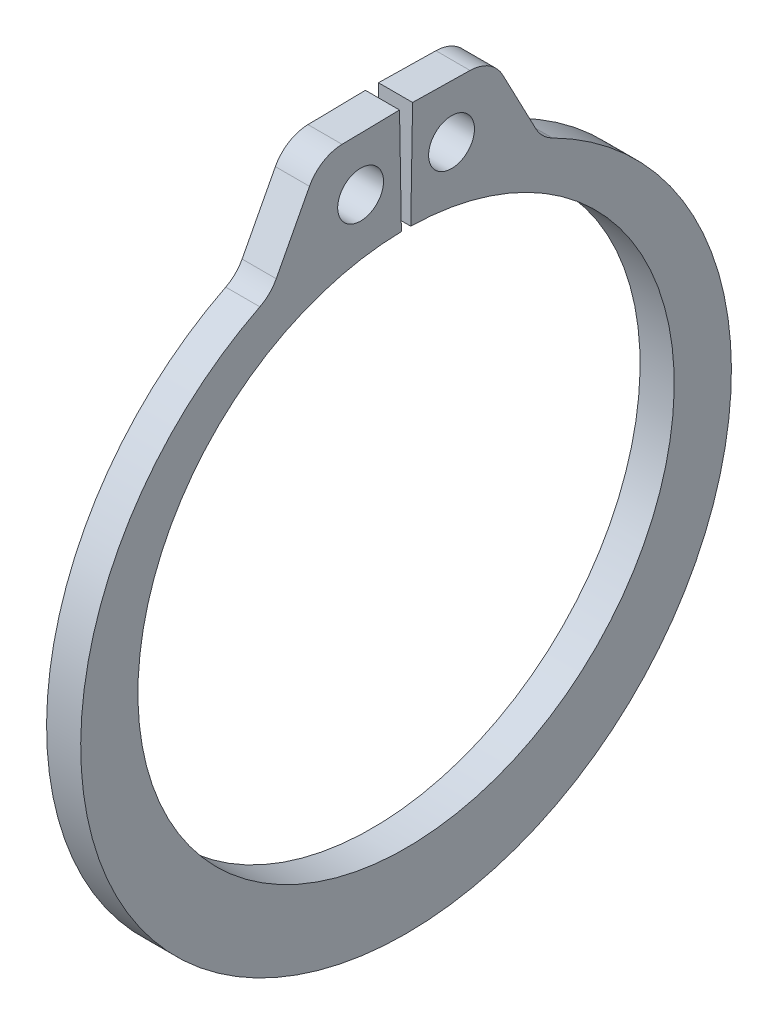
ISO-10303-21;
HEADER;
FILE_DESCRIPTION(('STEP AP214'),'2;1');
FILE_NAME('part.step','',(''),(''),'','','');
FILE_SCHEMA(('AUTOMOTIVE_DESIGN { 1 0 10303 214 1 1 1 1 }'));
ENDSEC;
DATA;
#1=APPLICATION_CONTEXT('core data for automotive mechanical design processes');
#2=APPLICATION_PROTOCOL_DEFINITION('international standard','automotive_design',2000,#1);
#3=PRODUCT_CONTEXT('',#1,'mechanical');
#4=PRODUCT('Part','Part','',(#3));
#5=PRODUCT_RELATED_PRODUCT_CATEGORY('part','',(#4));
#6=PRODUCT_DEFINITION_FORMATION('','',#4);
#7=PRODUCT_DEFINITION_CONTEXT('part definition',#1,'design');
#8=PRODUCT_DEFINITION('design','',#6,#7);
#9=PRODUCT_DEFINITION_SHAPE('','',#8);
#10=(LENGTH_UNIT() NAMED_UNIT(*) SI_UNIT(.MILLI.,.METRE.));
#11=(NAMED_UNIT(*) PLANE_ANGLE_UNIT() SI_UNIT($,.RADIAN.));
#12=(NAMED_UNIT(*) SI_UNIT($,.STERADIAN.) SOLID_ANGLE_UNIT());
#13=UNCERTAINTY_MEASURE_WITH_UNIT(LENGTH_MEASURE(1.E-05),#10,'distance_accuracy_value','');
#14=(GEOMETRIC_REPRESENTATION_CONTEXT(3) GLOBAL_UNCERTAINTY_ASSIGNED_CONTEXT((#13)) GLOBAL_UNIT_ASSIGNED_CONTEXT((#10,
#11,#12)) REPRESENTATION_CONTEXT('',''));
#15=CARTESIAN_POINT('',(0.,0.,0.));
#16=DIRECTION('',(0.,0.,1.));
#17=DIRECTION('',(1.,0.,0.));
#18=AXIS2_PLACEMENT_3D('',#15,#16,#17);
#19=CARTESIAN_POINT('',(0.4445,0.,0.));
#20=DIRECTION('',(1.,0.,0.));
#21=DIRECTION('',(0.,0.,-1.));
#22=AXIS2_PLACEMENT_3D('',#19,#20,#21);
#23=PLANE('',#22);
#24=CARTESIAN_POINT('',(0.4445,8.34990579039907,1.18413129849929));
#25=DIRECTION('',(1.,0.,0.));
#26=DIRECTION('',(0.,0.,-1.));
#27=AXIS2_PLACEMENT_3D('',#24,#25,#26);
#28=CIRCLE('',#27,0.5969);
#29=CARTESIAN_POINT('',(0.4445,8.34990579039907,0.587231298499288));
#30=VERTEX_POINT('',#29);
#31=EDGE_CURVE('E218',#30,#30,#28,.T.);
#32=ORIENTED_EDGE('',*,*,#31,.F.);
#33=EDGE_LOOP('',(#32));
#34=FACE_BOUND('',#33,.T.);
#35=DIRECTION('',(0.,-0.0174524064372785,0.999847695156391));
#36=VECTOR('',#35,1.);
#37=CARTESIAN_POINT('',(0.4445,9.75211447947738,0.170223791426689));
#38=LINE('',#37,#36);
#39=CARTESIAN_POINT('',(0.4445,9.75211447947738,0.170223791426689));
#40=VERTEX_POINT('',#39);
#41=CARTESIAN_POINT('',(0.4445,9.72599428346698,1.66664881865075));
#42=VERTEX_POINT('',#41);
#43=EDGE_CURVE('E130',#40,#42,#38,.T.);
#44=ORIENTED_EDGE('',*,*,#43,.T.);
#45=CARTESIAN_POINT('',(0.4445,8.74824322237355,1.64958211039574));
#46=DIRECTION('',(1.,0.,0.));
#47=DIRECTION('',(0.,0.,-1.));
#48=AXIS2_PLACEMENT_3D('',#45,#46,#47);
#49=CIRCLE('',#48,0.9779);
#50=CARTESIAN_POINT('',(0.4445,9.20239794825594,2.51562592854739));
#51=VERTEX_POINT('',#50);
#52=EDGE_CURVE('E171',#42,#51,#49,.T.);
#53=ORIENTED_EDGE('',*,*,#52,.T.);
#54=DIRECTION('',(0.,-0.885615930209273,0.464418371901418));
#55=VECTOR('',#54,1.);
#56=CARTESIAN_POINT('',(0.4445,9.71587543013069,2.24635753803418));
#57=LINE('',#56,#55);
#58=CARTESIAN_POINT('',(0.4445,7.55065021083085,3.38180501232419));
#59=VERTEX_POINT('',#58);
#60=EDGE_CURVE('E210',#51,#59,#57,.T.);
#61=ORIENTED_EDGE('',*,*,#60,.T.);
#62=CARTESIAN_POINT('',(0.4445,8.00480493671325,4.24784883047584));
#63=DIRECTION('',(1.,0.,0.));
#64=DIRECTION('',(0.,0.,-1.));
#65=AXIS2_PLACEMENT_3D('',#62,#63,#64);
#66=CIRCLE('',#65,0.9779);
#67=CARTESIAN_POINT('',(0.4445,7.13119661908455,3.80842088715641));
#68=VERTEX_POINT('',#67);
#69=EDGE_CURVE('E178',#59,#68,#66,.F.);
#70=ORIENTED_EDGE('',*,*,#69,.T.);
#71=CARTESIAN_POINT('',(0.4445,-0.440165681906266,0.));
#72=DIRECTION('',(1.,0.,0.));
#73=DIRECTION('',(0.,0.,-1.));
#74=AXIS2_PLACEMENT_3D('',#71,#72,#73);
#75=CIRCLE('',#74,8.47523431809375);
#76=CARTESIAN_POINT('',(0.4445,7.13119661908455,-3.80842088715641));
#77=VERTEX_POINT('',#76);
#78=EDGE_CURVE('E203',#68,#77,#75,.T.);
#79=ORIENTED_EDGE('',*,*,#78,.T.);
#80=CARTESIAN_POINT('',(0.4445,8.00480493671325,-4.24784883047584));
#81=DIRECTION('',(1.,0.,0.));
#82=DIRECTION('',(0.,0.,-1.));
#83=AXIS2_PLACEMENT_3D('',#80,#81,#82);
#84=CIRCLE('',#83,0.9779);
#85=CARTESIAN_POINT('',(0.4445,7.55065021083085,-3.38180501232419));
#86=VERTEX_POINT('',#85);
#87=EDGE_CURVE('E11',#77,#86,#84,.F.);
#88=ORIENTED_EDGE('',*,*,#87,.T.);
#89=DIRECTION('',(0.,0.885615930209273,0.464418371901418));
#90=VECTOR('',#89,1.);
#91=CARTESIAN_POINT('',(0.4445,9.71587543013069,-2.24635753803418));
#92=LINE('',#91,#90);
#93=CARTESIAN_POINT('',(0.4445,9.20239794825594,-2.51562592854739));
#94=VERTEX_POINT('',#93);
#95=EDGE_CURVE('E202',#86,#94,#92,.T.);
#96=ORIENTED_EDGE('',*,*,#95,.T.);
#97=CARTESIAN_POINT('',(0.4445,8.74824322237355,-1.64958211039574));
#98=DIRECTION('',(1.,0.,0.));
#99=DIRECTION('',(0.,0.,-1.));
#100=AXIS2_PLACEMENT_3D('',#97,#98,#99);
#101=CIRCLE('',#100,0.9779);
#102=CARTESIAN_POINT('',(0.4445,9.72599428346698,-1.66664881865075));
#103=VERTEX_POINT('',#102);
#104=EDGE_CURVE('E46',#94,#103,#101,.T.);
#105=ORIENTED_EDGE('',*,*,#104,.T.);
#106=DIRECTION('',(0.,0.0174524064372785,0.999847695156391));
#107=VECTOR('',#106,1.);
#108=CARTESIAN_POINT('',(0.4445,9.75211447947738,-0.170223791426689));
#109=LINE('',#108,#107);
#110=CARTESIAN_POINT('',(0.4445,9.75211447947738,-0.170223791426689));
#111=VERTEX_POINT('',#110);
#112=EDGE_CURVE('E207',#103,#111,#109,.T.);
#113=ORIENTED_EDGE('',*,*,#112,.T.);
#114=DIRECTION('',(0.,-0.999847695156391,0.0174524064372834));
#115=VECTOR('',#114,1.);
#116=CARTESIAN_POINT('',(0.4445,6.98393615066739,-0.121905058964426));
#117=LINE('',#116,#115);
#118=CARTESIAN_POINT('',(0.4445,6.98393615066739,-0.121905058964426));
#119=VERTEX_POINT('',#118);
#120=EDGE_CURVE('E136',#111,#119,#117,.T.);
#121=ORIENTED_EDGE('',*,*,#120,.T.);
#122=CARTESIAN_POINT('',(0.4445,0.,0.));
#123=DIRECTION('',(-1.,0.,0.));
#124=DIRECTION('',(0.,0.,-1.));
#125=AXIS2_PLACEMENT_3D('',#122,#123,#124);
#126=CIRCLE('',#125,6.985);
#127=CARTESIAN_POINT('',(0.4445,6.98393615066739,0.121905058964426));
#128=VERTEX_POINT('',#127);
#129=EDGE_CURVE('E131',#119,#128,#126,.T.);
#130=ORIENTED_EDGE('',*,*,#129,.T.);
#131=DIRECTION('',(0.,0.999847695156391,0.0174524064372834));
#132=VECTOR('',#131,1.);
#133=CARTESIAN_POINT('',(0.4445,6.98393615066739,0.121905058964426));
#134=LINE('',#133,#132);
#135=EDGE_CURVE('E122',#128,#40,#134,.T.);
#136=ORIENTED_EDGE('',*,*,#135,.T.);
#137=EDGE_LOOP('',(#44,#53,#61,#70,#79,#88,#96,#105,#113,#121,#130,#136));
#138=FACE_BOUND('',#137,.T.);
#139=CARTESIAN_POINT('',(0.4445,8.34990579039907,-1.18413129849929));
#140=DIRECTION('',(1.,0.,0.));
#141=DIRECTION('',(0.,0.,-1.));
#142=AXIS2_PLACEMENT_3D('',#139,#140,#141);
#143=CIRCLE('',#142,0.5969);
#144=CARTESIAN_POINT('',(0.4445,8.34990579039907,-1.78103129849929));
#145=VERTEX_POINT('',#144);
#146=EDGE_CURVE('E244',#145,#145,#143,.T.);
#147=ORIENTED_EDGE('',*,*,#146,.F.);
#148=EDGE_LOOP('',(#147));
#149=FACE_BOUND('',#148,.T.);
#150=ADVANCED_FACE('F31',(#34,#138,#149),#23,.T.);
#151=CARTESIAN_POINT('',(-0.4445,0.,0.));
#152=DIRECTION('',(1.,0.,0.));
#153=DIRECTION('',(0.,0.,-1.));
#154=AXIS2_PLACEMENT_3D('',#151,#152,#153);
#155=PLANE('',#154);
#156=CARTESIAN_POINT('',(-0.4445,8.34990579039907,1.18413129849929));
#157=DIRECTION('',(1.,0.,0.));
#158=DIRECTION('',(0.,0.,-1.));
#159=AXIS2_PLACEMENT_3D('',#156,#157,#158);
#160=CIRCLE('',#159,0.5969);
#161=CARTESIAN_POINT('',(-0.4445,8.34990579039907,0.587231298499288));
#162=VERTEX_POINT('',#161);
#163=EDGE_CURVE('E241',#162,#162,#160,.T.);
#164=ORIENTED_EDGE('',*,*,#163,.T.);
#165=EDGE_LOOP('',(#164));
#166=FACE_BOUND('',#165,.T.);
#167=DIRECTION('',(0.,-0.885615930209273,0.464418371901418));
#168=VECTOR('',#167,1.);
#169=CARTESIAN_POINT('',(-0.4445,9.71587543013069,2.24635753803418));
#170=LINE('',#169,#168);
#171=CARTESIAN_POINT('',(-0.4445,9.20239794825594,2.51562592854739));
#172=VERTEX_POINT('',#171);
#173=CARTESIAN_POINT('',(-0.4445,7.55065021083085,3.38180501232419));
#174=VERTEX_POINT('',#173);
#175=EDGE_CURVE('E197',#172,#174,#170,.T.);
#176=ORIENTED_EDGE('',*,*,#175,.F.);
#177=CARTESIAN_POINT('',(-0.4445,8.74824322237355,1.64958211039574));
#178=DIRECTION('',(1.,0.,0.));
#179=DIRECTION('',(0.,0.,-1.));
#180=AXIS2_PLACEMENT_3D('',#177,#178,#179);
#181=CIRCLE('',#180,0.9779);
#182=CARTESIAN_POINT('',(-0.4445,9.72599428346698,1.66664881865075));
#183=VERTEX_POINT('',#182);
#184=EDGE_CURVE('E167',#172,#183,#181,.F.);
#185=ORIENTED_EDGE('',*,*,#184,.T.);
#186=DIRECTION('',(0.,-0.0174524064372785,0.999847695156391));
#187=VECTOR('',#186,1.);
#188=CARTESIAN_POINT('',(-0.4445,9.75211447947738,0.170223791426689));
#189=LINE('',#188,#187);
#190=CARTESIAN_POINT('',(-0.4445,9.75211447947738,0.170223791426689));
#191=VERTEX_POINT('',#190);
#192=EDGE_CURVE('E220',#191,#183,#189,.T.);
#193=ORIENTED_EDGE('',*,*,#192,.F.);
#194=DIRECTION('',(0.,0.999847695156391,0.0174524064372834));
#195=VECTOR('',#194,1.);
#196=CARTESIAN_POINT('',(-0.4445,6.98393615066739,0.121905058964426));
#197=LINE('',#196,#195);
#198=CARTESIAN_POINT('',(-0.4445,6.98393615066739,0.121905058964426));
#199=VERTEX_POINT('',#198);
#200=EDGE_CURVE('E217',#199,#191,#197,.T.);
#201=ORIENTED_EDGE('',*,*,#200,.F.);
#202=CARTESIAN_POINT('',(-0.4445,0.,0.));
#203=DIRECTION('',(-1.,0.,0.));
#204=DIRECTION('',(0.,0.,-1.));
#205=AXIS2_PLACEMENT_3D('',#202,#203,#204);
#206=CIRCLE('',#205,6.985);
#207=CARTESIAN_POINT('',(-0.4445,6.98393615066739,-0.121905058964426));
#208=VERTEX_POINT('',#207);
#209=EDGE_CURVE('E144',#208,#199,#206,.T.);
#210=ORIENTED_EDGE('',*,*,#209,.F.);
#211=DIRECTION('',(0.,-0.999847695156391,0.0174524064372834));
#212=VECTOR('',#211,1.);
#213=CARTESIAN_POINT('',(-0.4445,6.98393615066739,-0.121905058964426));
#214=LINE('',#213,#212);
#215=CARTESIAN_POINT('',(-0.4445,9.75211447947738,-0.170223791426689));
#216=VERTEX_POINT('',#215);
#217=EDGE_CURVE('E140',#216,#208,#214,.T.);
#218=ORIENTED_EDGE('',*,*,#217,.F.);
#219=DIRECTION('',(0.,0.0174524064372785,0.999847695156391));
#220=VECTOR('',#219,1.);
#221=CARTESIAN_POINT('',(-0.4445,9.75211447947738,-0.170223791426689));
#222=LINE('',#221,#220);
#223=CARTESIAN_POINT('',(-0.4445,9.72599428346698,-1.66664881865075));
#224=VERTEX_POINT('',#223);
#225=EDGE_CURVE('E225',#224,#216,#222,.T.);
#226=ORIENTED_EDGE('',*,*,#225,.F.);
#227=CARTESIAN_POINT('',(-0.4445,8.74824322237355,-1.64958211039574));
#228=DIRECTION('',(1.,0.,0.));
#229=DIRECTION('',(0.,0.,-1.));
#230=AXIS2_PLACEMENT_3D('',#227,#228,#229);
#231=CIRCLE('',#230,0.9779);
#232=CARTESIAN_POINT('',(-0.4445,9.20239794825594,-2.51562592854739));
#233=VERTEX_POINT('',#232);
#234=EDGE_CURVE('E165',#224,#233,#231,.F.);
#235=ORIENTED_EDGE('',*,*,#234,.T.);
#236=DIRECTION('',(0.,0.885615930209273,0.464418371901418));
#237=VECTOR('',#236,1.);
#238=CARTESIAN_POINT('',(-0.4445,9.71587543013069,-2.24635753803418));
#239=LINE('',#238,#237);
#240=CARTESIAN_POINT('',(-0.4445,7.55065021083085,-3.38180501232419));
#241=VERTEX_POINT('',#240);
#242=EDGE_CURVE('E188',#241,#233,#239,.T.);
#243=ORIENTED_EDGE('',*,*,#242,.F.);
#244=CARTESIAN_POINT('',(-0.4445,8.00480493671325,-4.24784883047584));
#245=DIRECTION('',(1.,0.,0.));
#246=DIRECTION('',(0.,0.,-1.));
#247=AXIS2_PLACEMENT_3D('',#244,#245,#246);
#248=CIRCLE('',#247,0.9779);
#249=CARTESIAN_POINT('',(-0.4445,7.13119661908455,-3.80842088715641));
#250=VERTEX_POINT('',#249);
#251=EDGE_CURVE('E39',#241,#250,#248,.T.);
#252=ORIENTED_EDGE('',*,*,#251,.T.);
#253=CARTESIAN_POINT('',(-0.4445,-0.440165681906266,0.));
#254=DIRECTION('',(1.,0.,0.));
#255=DIRECTION('',(0.,0.,-1.));
#256=AXIS2_PLACEMENT_3D('',#253,#254,#255);
#257=CIRCLE('',#256,8.47523431809375);
#258=CARTESIAN_POINT('',(-0.4445,7.13119661908455,3.80842088715641));
#259=VERTEX_POINT('',#258);
#260=EDGE_CURVE('E186',#259,#250,#257,.T.);
#261=ORIENTED_EDGE('',*,*,#260,.F.);
#262=CARTESIAN_POINT('',(-0.4445,8.00480493671325,4.24784883047584));
#263=DIRECTION('',(1.,0.,0.));
#264=DIRECTION('',(0.,0.,-1.));
#265=AXIS2_PLACEMENT_3D('',#262,#263,#264);
#266=CIRCLE('',#265,0.9779);
#267=EDGE_CURVE('E176',#259,#174,#266,.T.);
#268=ORIENTED_EDGE('',*,*,#267,.T.);
#269=EDGE_LOOP('',(#176,#185,#193,#201,#210,#218,#226,#235,#243,#252,#261,#268));
#270=FACE_BOUND('',#269,.T.);
#271=CARTESIAN_POINT('',(-0.4445,8.34990579039907,-1.18413129849929));
#272=DIRECTION('',(1.,0.,0.));
#273=DIRECTION('',(0.,0.,-1.));
#274=AXIS2_PLACEMENT_3D('',#271,#272,#273);
#275=CIRCLE('',#274,0.5969);
#276=CARTESIAN_POINT('',(-0.4445,8.34990579039907,-1.78103129849929));
#277=VERTEX_POINT('',#276);
#278=EDGE_CURVE('E247',#277,#277,#275,.T.);
#279=ORIENTED_EDGE('',*,*,#278,.T.);
#280=EDGE_LOOP('',(#279));
#281=FACE_BOUND('',#280,.T.);
#282=ADVANCED_FACE('F184',(#166,#270,#281),#155,.F.);
#283=CARTESIAN_POINT('',(0.4445,0.,0.));
#284=DIRECTION('',(-1.,0.,0.));
#285=DIRECTION('',(0.,0.,1.));
#286=AXIS2_PLACEMENT_3D('',#283,#284,#285);
#287=CYLINDRICAL_SURFACE('',#286,6.985);
#288=ORIENTED_EDGE('',*,*,#209,.T.);
#289=DIRECTION('',(-1.,0.,0.));
#290=VECTOR('',#289,1.);
#291=CARTESIAN_POINT('',(0.4445,6.98393615066739,0.121905058964426));
#292=LINE('',#291,#290);
#293=EDGE_CURVE('E126',#128,#199,#292,.T.);
#294=ORIENTED_EDGE('',*,*,#293,.F.);
#295=ORIENTED_EDGE('',*,*,#129,.F.);
#296=DIRECTION('',(-1.,0.,0.));
#297=VECTOR('',#296,1.);
#298=CARTESIAN_POINT('',(0.4445,6.98393615066739,-0.121905058964426));
#299=LINE('',#298,#297);
#300=EDGE_CURVE('E215',#119,#208,#299,.T.);
#301=ORIENTED_EDGE('',*,*,#300,.T.);
#302=EDGE_LOOP('',(#288,#294,#295,#301));
#303=FACE_BOUND('',#302,.T.);
#304=ADVANCED_FACE('F142',(#303),#287,.F.);
#305=CARTESIAN_POINT('',(0.4445,6.98393615066739,0.121905058964426));
#306=DIRECTION('',(0.,-0.0174524064372834,0.999847695156391));
#307=DIRECTION('',(0.,-0.999847695156391,-0.0174524064372834));
#308=AXIS2_PLACEMENT_3D('',#305,#306,#307);
#309=PLANE('',#308);
#310=ORIENTED_EDGE('',*,*,#200,.T.);
#311=DIRECTION('',(-1.,0.,0.));
#312=VECTOR('',#311,1.);
#313=CARTESIAN_POINT('',(0.4445,9.75211447947738,0.170223791426689));
#314=LINE('',#313,#312);
#315=EDGE_CURVE('E129',#40,#191,#314,.T.);
#316=ORIENTED_EDGE('',*,*,#315,.F.);
#317=ORIENTED_EDGE('',*,*,#135,.F.);
#318=ORIENTED_EDGE('',*,*,#293,.T.);
#319=EDGE_LOOP('',(#310,#316,#317,#318));
#320=FACE_BOUND('',#319,.T.);
#321=ADVANCED_FACE('F124',(#320),#309,.F.);
#322=CARTESIAN_POINT('',(0.4445,9.75211447947738,0.170223791426689));
#323=DIRECTION('',(0.,-0.999847695156391,-0.0174524064372785));
#324=DIRECTION('',(0.,0.0174524064372785,-0.999847695156391));
#325=AXIS2_PLACEMENT_3D('',#322,#323,#324);
#326=PLANE('',#325);
#327=ORIENTED_EDGE('',*,*,#192,.T.);
#328=DIRECTION('',(-1.,0.,0.));
#329=VECTOR('',#328,1.);
#330=CARTESIAN_POINT('',(0.4445,9.72599428346698,1.66664881865075));
#331=LINE('',#330,#329);
#332=EDGE_CURVE('E54',#183,#42,#331,.F.);
#333=ORIENTED_EDGE('',*,*,#332,.T.);
#334=ORIENTED_EDGE('',*,*,#43,.F.);
#335=ORIENTED_EDGE('',*,*,#315,.T.);
#336=EDGE_LOOP('',(#327,#333,#334,#335));
#337=FACE_BOUND('',#336,.T.);
#338=ADVANCED_FACE('F236',(#337),#326,.F.);
#339=CARTESIAN_POINT('',(0.4445,9.71587543013069,2.24635753803418));
#340=DIRECTION('',(0.,-0.464418371901418,-0.885615930209273));
#341=DIRECTION('',(0.,0.885615930209273,-0.464418371901418));
#342=AXIS2_PLACEMENT_3D('',#339,#340,#341);
#343=PLANE('',#342);
#344=ORIENTED_EDGE('',*,*,#175,.T.);
#345=DIRECTION('',(1.,0.,0.));
#346=VECTOR('',#345,1.);
#347=CARTESIAN_POINT('',(0.4445,7.55065021083085,3.38180501232419));
#348=LINE('',#347,#346);
#349=EDGE_CURVE('E158',#174,#59,#348,.T.);
#350=ORIENTED_EDGE('',*,*,#349,.T.);
#351=ORIENTED_EDGE('',*,*,#60,.F.);
#352=DIRECTION('',(-1.,0.,0.));
#353=VECTOR('',#352,1.);
#354=CARTESIAN_POINT('',(0.4445,9.20239794825594,2.51562592854739));
#355=LINE('',#354,#353);
#356=EDGE_CURVE('E155',#51,#172,#355,.T.);
#357=ORIENTED_EDGE('',*,*,#356,.T.);
#358=EDGE_LOOP('',(#344,#350,#351,#357));
#359=FACE_BOUND('',#358,.T.);
#360=ADVANCED_FACE('F277',(#359),#343,.F.);
#361=CARTESIAN_POINT('',(0.4445,-0.440165681906266,0.));
#362=DIRECTION('',(-1.,0.,0.));
#363=DIRECTION('',(0.,0.,1.));
#364=AXIS2_PLACEMENT_3D('',#361,#362,#363);
#365=CYLINDRICAL_SURFACE('',#364,8.47523431809375);
#366=ORIENTED_EDGE('',*,*,#78,.F.);
#367=DIRECTION('',(-1.,0.,0.));
#368=VECTOR('',#367,1.);
#369=CARTESIAN_POINT('',(0.4445,7.13119661908455,3.80842088715641));
#370=LINE('',#369,#368);
#371=EDGE_CURVE('E147',#68,#259,#370,.T.);
#372=ORIENTED_EDGE('',*,*,#371,.T.);
#373=ORIENTED_EDGE('',*,*,#260,.T.);
#374=DIRECTION('',(-1.,0.,0.));
#375=VECTOR('',#374,1.);
#376=CARTESIAN_POINT('',(0.4445,7.13119661908455,-3.80842088715641));
#377=LINE('',#376,#375);
#378=EDGE_CURVE('E145',#250,#77,#377,.F.);
#379=ORIENTED_EDGE('',*,*,#378,.T.);
#380=EDGE_LOOP('',(#366,#372,#373,#379));
#381=FACE_BOUND('',#380,.T.);
#382=ADVANCED_FACE('F194',(#381),#365,.T.);
#383=CARTESIAN_POINT('',(0.4445,9.71587543013069,-2.24635753803418));
#384=DIRECTION('',(0.,-0.464418371901418,0.885615930209273));
#385=DIRECTION('',(0.,-0.885615930209273,-0.464418371901418));
#386=AXIS2_PLACEMENT_3D('',#383,#384,#385);
#387=PLANE('',#386);
#388=ORIENTED_EDGE('',*,*,#95,.F.);
#389=DIRECTION('',(1.,0.,0.));
#390=VECTOR('',#389,1.);
#391=CARTESIAN_POINT('',(-0.4445,7.55065021083085,-3.38180501232419));
#392=LINE('',#391,#390);
#393=EDGE_CURVE('E162',#86,#241,#392,.F.);
#394=ORIENTED_EDGE('',*,*,#393,.T.);
#395=ORIENTED_EDGE('',*,*,#242,.T.);
#396=DIRECTION('',(-1.,0.,0.));
#397=VECTOR('',#396,1.);
#398=CARTESIAN_POINT('',(0.4445,9.20239794825594,-2.51562592854739));
#399=LINE('',#398,#397);
#400=EDGE_CURVE('E160',#233,#94,#399,.F.);
#401=ORIENTED_EDGE('',*,*,#400,.T.);
#402=EDGE_LOOP('',(#388,#394,#395,#401));
#403=FACE_BOUND('',#402,.T.);
#404=ADVANCED_FACE('F205',(#403),#387,.F.);
#405=CARTESIAN_POINT('',(0.4445,9.75211447947738,-0.170223791426689));
#406=DIRECTION('',(0.,-0.999847695156391,0.0174524064372785));
#407=DIRECTION('',(0.,-0.0174524064372785,-0.999847695156391));
#408=AXIS2_PLACEMENT_3D('',#405,#406,#407);
#409=PLANE('',#408);
#410=ORIENTED_EDGE('',*,*,#112,.F.);
#411=DIRECTION('',(-1.,0.,0.));
#412=VECTOR('',#411,1.);
#413=CARTESIAN_POINT('',(0.4445,9.72599428346698,-1.66664881865075));
#414=LINE('',#413,#412);
#415=EDGE_CURVE('E173',#103,#224,#414,.T.);
#416=ORIENTED_EDGE('',*,*,#415,.T.);
#417=ORIENTED_EDGE('',*,*,#225,.T.);
#418=DIRECTION('',(-1.,0.,0.));
#419=VECTOR('',#418,1.);
#420=CARTESIAN_POINT('',(0.4445,9.75211447947738,-0.170223791426689));
#421=LINE('',#420,#419);
#422=EDGE_CURVE('E149',#111,#216,#421,.T.);
#423=ORIENTED_EDGE('',*,*,#422,.F.);
#424=EDGE_LOOP('',(#410,#416,#417,#423));
#425=FACE_BOUND('',#424,.T.);
#426=ADVANCED_FACE('F270',(#425),#409,.F.);
#427=CARTESIAN_POINT('',(0.4445,6.98393615066739,-0.121905058964426));
#428=DIRECTION('',(0.,-0.0174524064372834,-0.999847695156391));
#429=DIRECTION('',(0.,0.999847695156391,-0.0174524064372834));
#430=AXIS2_PLACEMENT_3D('',#427,#428,#429);
#431=PLANE('',#430);
#432=ORIENTED_EDGE('',*,*,#217,.T.);
#433=ORIENTED_EDGE('',*,*,#300,.F.);
#434=ORIENTED_EDGE('',*,*,#120,.F.);
#435=ORIENTED_EDGE('',*,*,#422,.T.);
#436=EDGE_LOOP('',(#432,#433,#434,#435));
#437=FACE_BOUND('',#436,.T.);
#438=ADVANCED_FACE('F232',(#437),#431,.F.);
#439=CARTESIAN_POINT('',(0.4445,8.34990579039907,1.18413129849929));
#440=DIRECTION('',(-1.,0.,0.));
#441=DIRECTION('',(0.,0.,1.));
#442=AXIS2_PLACEMENT_3D('',#439,#440,#441);
#443=CYLINDRICAL_SURFACE('',#442,0.5969);
#444=ORIENTED_EDGE('',*,*,#31,.T.);
#445=EDGE_LOOP('',(#444));
#446=FACE_BOUND('',#445,.T.);
#447=ORIENTED_EDGE('',*,*,#163,.F.);
#448=EDGE_LOOP('',(#447));
#449=FACE_BOUND('',#448,.T.);
#450=ADVANCED_FACE('F265',(#446,#449),#443,.F.);
#451=CARTESIAN_POINT('',(0.4445,8.34990579039907,-1.18413129849929));
#452=DIRECTION('',(-1.,0.,0.));
#453=DIRECTION('',(0.,0.,1.));
#454=AXIS2_PLACEMENT_3D('',#451,#452,#453);
#455=CYLINDRICAL_SURFACE('',#454,0.5969);
#456=ORIENTED_EDGE('',*,*,#146,.T.);
#457=EDGE_LOOP('',(#456));
#458=FACE_BOUND('',#457,.T.);
#459=ORIENTED_EDGE('',*,*,#278,.F.);
#460=EDGE_LOOP('',(#459));
#461=FACE_BOUND('',#460,.T.);
#462=ADVANCED_FACE('F253',(#458,#461),#455,.F.);
#463=CARTESIAN_POINT('',(0.4445,8.00480493671325,4.24784883047584));
#464=DIRECTION('',(-1.,0.,0.));
#465=DIRECTION('',(0.,0.,1.));
#466=AXIS2_PLACEMENT_3D('',#463,#464,#465);
#467=CYLINDRICAL_SURFACE('',#466,0.9779);
#468=ORIENTED_EDGE('',*,*,#69,.F.);
#469=ORIENTED_EDGE('',*,*,#349,.F.);
#470=ORIENTED_EDGE('',*,*,#267,.F.);
#471=ORIENTED_EDGE('',*,*,#371,.F.);
#472=EDGE_LOOP('',(#468,#469,#470,#471));
#473=FACE_BOUND('',#472,.T.);
#474=ADVANCED_FACE('F287',(#473),#467,.F.);
#475=CARTESIAN_POINT('',(0.4445,8.00480493671325,-4.24784883047584));
#476=DIRECTION('',(-1.,0.,0.));
#477=DIRECTION('',(0.,0.,1.));
#478=AXIS2_PLACEMENT_3D('',#475,#476,#477);
#479=CYLINDRICAL_SURFACE('',#478,0.9779);
#480=ORIENTED_EDGE('',*,*,#87,.F.);
#481=ORIENTED_EDGE('',*,*,#378,.F.);
#482=ORIENTED_EDGE('',*,*,#251,.F.);
#483=ORIENTED_EDGE('',*,*,#393,.F.);
#484=EDGE_LOOP('',(#480,#481,#482,#483));
#485=FACE_BOUND('',#484,.T.);
#486=ADVANCED_FACE('F200',(#485),#479,.F.);
#487=CARTESIAN_POINT('',(0.4445,8.74824322237355,1.64958211039574));
#488=DIRECTION('',(-1.,0.,0.));
#489=DIRECTION('',(0.,0.,1.));
#490=AXIS2_PLACEMENT_3D('',#487,#488,#489);
#491=CYLINDRICAL_SURFACE('',#490,0.9779);
#492=ORIENTED_EDGE('',*,*,#52,.F.);
#493=ORIENTED_EDGE('',*,*,#332,.F.);
#494=ORIENTED_EDGE('',*,*,#184,.F.);
#495=ORIENTED_EDGE('',*,*,#356,.F.);
#496=EDGE_LOOP('',(#492,#493,#494,#495));
#497=FACE_BOUND('',#496,.T.);
#498=ADVANCED_FACE('F292',(#497),#491,.T.);
#499=CARTESIAN_POINT('',(0.4445,8.74824322237355,-1.64958211039574));
#500=DIRECTION('',(-1.,0.,0.));
#501=DIRECTION('',(0.,0.,1.));
#502=AXIS2_PLACEMENT_3D('',#499,#500,#501);
#503=CYLINDRICAL_SURFACE('',#502,0.9779);
#504=ORIENTED_EDGE('',*,*,#104,.F.);
#505=ORIENTED_EDGE('',*,*,#400,.F.);
#506=ORIENTED_EDGE('',*,*,#234,.F.);
#507=ORIENTED_EDGE('',*,*,#415,.F.);
#508=EDGE_LOOP('',(#504,#505,#506,#507));
#509=FACE_BOUND('',#508,.T.);
#510=ADVANCED_FACE('F33',(#509),#503,.T.);
#511=CLOSED_SHELL('',(#150,#282,#304,#321,#338,#360,#382,#404,#426,#438,#450,#462,#474,#486,
#498,#510));
#512=MANIFOLD_SOLID_BREP('B2',#511);
#513=ADVANCED_BREP_SHAPE_REPRESENTATION('',(#18,#512),#14);
#514=SHAPE_DEFINITION_REPRESENTATION(#9,#513);
ENDSEC;
END-ISO-10303-21;
